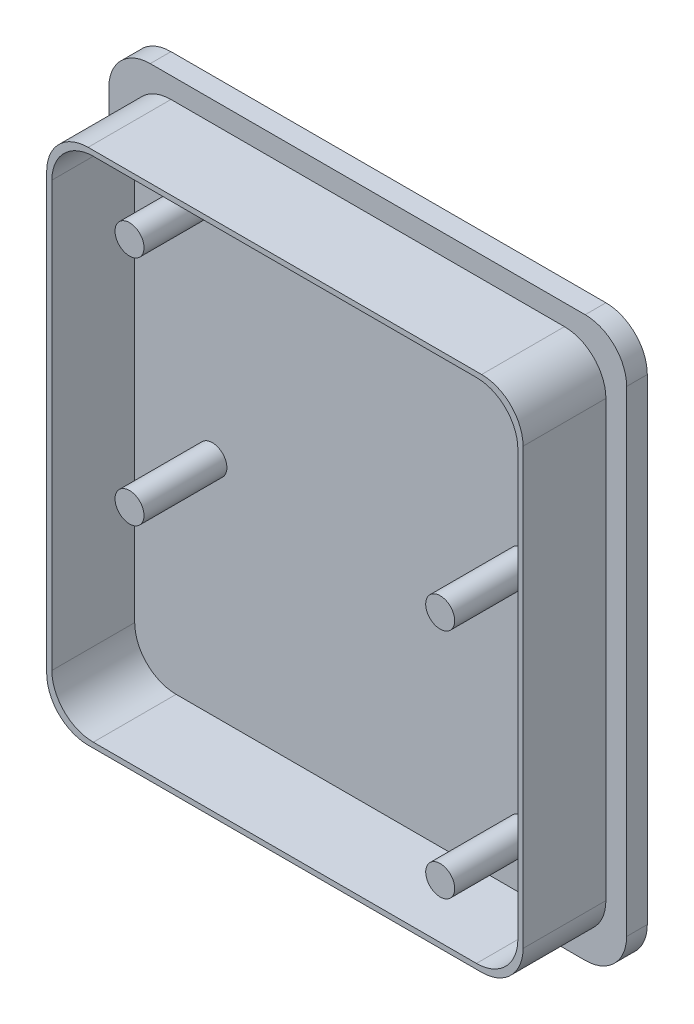
ISO-10303-21;
HEADER;
FILE_DESCRIPTION(('STEP AP214'),'2;1');
FILE_NAME('part.step','',(''),(''),'','','');
FILE_SCHEMA(('AUTOMOTIVE_DESIGN { 1 0 10303 214 1 1 1 1 }'));
ENDSEC;
DATA;
#1=APPLICATION_CONTEXT('core data for automotive mechanical design processes');
#2=APPLICATION_PROTOCOL_DEFINITION('international standard','automotive_design',2000,#1);
#3=PRODUCT_CONTEXT('',#1,'mechanical');
#4=PRODUCT('Part','Part','',(#3));
#5=PRODUCT_RELATED_PRODUCT_CATEGORY('part','',(#4));
#6=PRODUCT_DEFINITION_FORMATION('','',#4);
#7=PRODUCT_DEFINITION_CONTEXT('part definition',#1,'design');
#8=PRODUCT_DEFINITION('design','',#6,#7);
#9=PRODUCT_DEFINITION_SHAPE('','',#8);
#10=(LENGTH_UNIT() NAMED_UNIT(*) SI_UNIT(.MILLI.,.METRE.));
#11=(NAMED_UNIT(*) PLANE_ANGLE_UNIT() SI_UNIT($,.RADIAN.));
#12=(NAMED_UNIT(*) SI_UNIT($,.STERADIAN.) SOLID_ANGLE_UNIT());
#13=UNCERTAINTY_MEASURE_WITH_UNIT(LENGTH_MEASURE(1.E-05),#10,'distance_accuracy_value','');
#14=(GEOMETRIC_REPRESENTATION_CONTEXT(3) GLOBAL_UNCERTAINTY_ASSIGNED_CONTEXT((#13)) GLOBAL_UNIT_ASSIGNED_CONTEXT((#10,
#11,#12)) REPRESENTATION_CONTEXT('',''));
#15=CARTESIAN_POINT('',(0.,0.,0.));
#16=DIRECTION('',(0.,0.,1.));
#17=DIRECTION('',(1.,0.,0.));
#18=AXIS2_PLACEMENT_3D('',#15,#16,#17);
#19=CARTESIAN_POINT('',(-21.,23.,10.));
#20=DIRECTION('',(0.,0.,-1.));
#21=DIRECTION('',(-1.,0.,0.));
#22=AXIS2_PLACEMENT_3D('',#19,#20,#21);
#23=CYLINDRICAL_SURFACE('',#22,4.);
#24=CARTESIAN_POINT('',(-21.,23.,2.));
#25=DIRECTION('',(0.,0.,1.));
#26=DIRECTION('',(1.,0.,0.));
#27=AXIS2_PLACEMENT_3D('',#24,#25,#26);
#28=CIRCLE('',#27,4.);
#29=CARTESIAN_POINT('',(-21.,27.,2.));
#30=VERTEX_POINT('',#29);
#31=CARTESIAN_POINT('',(-25.,23.,2.));
#32=VERTEX_POINT('',#31);
#33=EDGE_CURVE('E250',#30,#32,#28,.T.);
#34=ORIENTED_EDGE('',*,*,#33,.F.);
#35=DIRECTION('',(0.,0.,-1.));
#36=VECTOR('',#35,1.);
#37=CARTESIAN_POINT('',(-21.,27.,10.));
#38=LINE('',#37,#36);
#39=CARTESIAN_POINT('',(-21.,27.,0.));
#40=VERTEX_POINT('',#39);
#41=EDGE_CURVE('E261',#30,#40,#38,.T.);
#42=ORIENTED_EDGE('',*,*,#41,.T.);
#43=CARTESIAN_POINT('',(-21.,23.,0.));
#44=DIRECTION('',(0.,0.,1.));
#45=DIRECTION('',(-1.,0.,0.));
#46=AXIS2_PLACEMENT_3D('',#43,#44,#45);
#47=CIRCLE('',#46,4.);
#48=CARTESIAN_POINT('',(-25.,23.,0.));
#49=VERTEX_POINT('',#48);
#50=EDGE_CURVE('E311',#40,#49,#47,.T.);
#51=ORIENTED_EDGE('',*,*,#50,.T.);
#52=DIRECTION('',(0.,0.,-1.));
#53=VECTOR('',#52,1.);
#54=CARTESIAN_POINT('',(-25.,23.,10.));
#55=LINE('',#54,#53);
#56=EDGE_CURVE('E12',#32,#49,#55,.T.);
#57=ORIENTED_EDGE('',*,*,#56,.F.);
#58=EDGE_LOOP('',(#34,#42,#51,#57));
#59=FACE_BOUND('',#58,.T.);
#60=ADVANCED_FACE('F88',(#59),#23,.T.);
#61=CARTESIAN_POINT('',(-25.,-23.,10.));
#62=DIRECTION('',(1.,0.,0.));
#63=DIRECTION('',(0.,1.,0.));
#64=AXIS2_PLACEMENT_3D('',#61,#62,#63);
#65=PLANE('',#64);
#66=DIRECTION('',(0.,-1.,0.));
#67=VECTOR('',#66,1.);
#68=CARTESIAN_POINT('',(-25.,0.,2.));
#69=LINE('',#68,#67);
#70=CARTESIAN_POINT('',(-25.,-23.,2.));
#71=VERTEX_POINT('',#70);
#72=EDGE_CURVE('E264',#32,#71,#69,.T.);
#73=ORIENTED_EDGE('',*,*,#72,.F.);
#74=ORIENTED_EDGE('',*,*,#56,.T.);
#75=DIRECTION('',(0.,-1.,0.));
#76=VECTOR('',#75,1.);
#77=CARTESIAN_POINT('',(-25.,-23.,0.));
#78=LINE('',#77,#76);
#79=CARTESIAN_POINT('',(-25.,-23.,0.));
#80=VERTEX_POINT('',#79);
#81=EDGE_CURVE('E307',#49,#80,#78,.T.);
#82=ORIENTED_EDGE('',*,*,#81,.T.);
#83=DIRECTION('',(0.,0.,-1.));
#84=VECTOR('',#83,1.);
#85=CARTESIAN_POINT('',(-25.,-23.,10.));
#86=LINE('',#85,#84);
#87=EDGE_CURVE('E96',#71,#80,#86,.T.);
#88=ORIENTED_EDGE('',*,*,#87,.F.);
#89=EDGE_LOOP('',(#73,#74,#82,#88));
#90=FACE_BOUND('',#89,.T.);
#91=ADVANCED_FACE('F308',(#90),#65,.F.);
#92=CARTESIAN_POINT('',(-21.,-23.,10.));
#93=DIRECTION('',(0.,0.,-1.));
#94=DIRECTION('',(-1.,0.,0.));
#95=AXIS2_PLACEMENT_3D('',#92,#93,#94);
#96=CYLINDRICAL_SURFACE('',#95,4.);
#97=CARTESIAN_POINT('',(-21.,-23.,2.));
#98=DIRECTION('',(0.,0.,1.));
#99=DIRECTION('',(1.,0.,0.));
#100=AXIS2_PLACEMENT_3D('',#97,#98,#99);
#101=CIRCLE('',#100,4.);
#102=CARTESIAN_POINT('',(-21.,-27.,2.));
#103=VERTEX_POINT('',#102);
#104=EDGE_CURVE('E304',#71,#103,#101,.T.);
#105=ORIENTED_EDGE('',*,*,#104,.F.);
#106=ORIENTED_EDGE('',*,*,#87,.T.);
#107=CARTESIAN_POINT('',(-21.,-23.,0.));
#108=DIRECTION('',(0.,0.,1.));
#109=DIRECTION('',(1.,0.,0.));
#110=AXIS2_PLACEMENT_3D('',#107,#108,#109);
#111=CIRCLE('',#110,4.);
#112=CARTESIAN_POINT('',(-21.,-27.,0.));
#113=VERTEX_POINT('',#112);
#114=EDGE_CURVE('E302',#80,#113,#111,.T.);
#115=ORIENTED_EDGE('',*,*,#114,.T.);
#116=DIRECTION('',(0.,0.,-1.));
#117=VECTOR('',#116,1.);
#118=CARTESIAN_POINT('',(-21.,-27.,10.));
#119=LINE('',#118,#117);
#120=EDGE_CURVE('E290',#103,#113,#119,.T.);
#121=ORIENTED_EDGE('',*,*,#120,.F.);
#122=EDGE_LOOP('',(#105,#106,#115,#121));
#123=FACE_BOUND('',#122,.T.);
#124=ADVANCED_FACE('F299',(#123),#96,.T.);
#125=CARTESIAN_POINT('',(-21.,-27.,10.));
#126=DIRECTION('',(0.,1.,0.));
#127=DIRECTION('',(-1.,0.,0.));
#128=AXIS2_PLACEMENT_3D('',#125,#126,#127);
#129=PLANE('',#128);
#130=DIRECTION('',(1.,0.,0.));
#131=VECTOR('',#130,1.);
#132=CARTESIAN_POINT('',(0.,-27.,2.));
#133=LINE('',#132,#131);
#134=CARTESIAN_POINT('',(21.,-27.,2.));
#135=VERTEX_POINT('',#134);
#136=EDGE_CURVE('E548',#103,#135,#133,.T.);
#137=ORIENTED_EDGE('',*,*,#136,.F.);
#138=ORIENTED_EDGE('',*,*,#120,.T.);
#139=DIRECTION('',(1.,0.,0.));
#140=VECTOR('',#139,1.);
#141=CARTESIAN_POINT('',(-21.,-27.,0.));
#142=LINE('',#141,#140);
#143=CARTESIAN_POINT('',(21.,-27.,0.));
#144=VERTEX_POINT('',#143);
#145=EDGE_CURVE('E316',#113,#144,#142,.T.);
#146=ORIENTED_EDGE('',*,*,#145,.T.);
#147=DIRECTION('',(0.,0.,-1.));
#148=VECTOR('',#147,1.);
#149=CARTESIAN_POINT('',(21.,-27.,10.));
#150=LINE('',#149,#148);
#151=EDGE_CURVE('E287',#135,#144,#150,.T.);
#152=ORIENTED_EDGE('',*,*,#151,.F.);
#153=EDGE_LOOP('',(#137,#138,#146,#152));
#154=FACE_BOUND('',#153,.T.);
#155=ADVANCED_FACE('F559',(#154),#129,.F.);
#156=CARTESIAN_POINT('',(21.,-23.,10.));
#157=DIRECTION('',(0.,0.,-1.));
#158=DIRECTION('',(-1.,0.,0.));
#159=AXIS2_PLACEMENT_3D('',#156,#157,#158);
#160=CYLINDRICAL_SURFACE('',#159,4.);
#161=CARTESIAN_POINT('',(21.,-23.,2.));
#162=DIRECTION('',(0.,0.,1.));
#163=DIRECTION('',(1.,0.,0.));
#164=AXIS2_PLACEMENT_3D('',#161,#162,#163);
#165=CIRCLE('',#164,4.);
#166=CARTESIAN_POINT('',(25.,-23.,2.));
#167=VERTEX_POINT('',#166);
#168=EDGE_CURVE('E545',#135,#167,#165,.T.);
#169=ORIENTED_EDGE('',*,*,#168,.F.);
#170=ORIENTED_EDGE('',*,*,#151,.T.);
#171=CARTESIAN_POINT('',(21.,-23.,0.));
#172=DIRECTION('',(0.,0.,1.));
#173=DIRECTION('',(-1.,0.,0.));
#174=AXIS2_PLACEMENT_3D('',#171,#172,#173);
#175=CIRCLE('',#174,4.);
#176=CARTESIAN_POINT('',(25.,-23.,0.));
#177=VERTEX_POINT('',#176);
#178=EDGE_CURVE('E321',#144,#177,#175,.T.);
#179=ORIENTED_EDGE('',*,*,#178,.T.);
#180=DIRECTION('',(0.,0.,-1.));
#181=VECTOR('',#180,1.);
#182=CARTESIAN_POINT('',(25.,-23.,10.));
#183=LINE('',#182,#181);
#184=EDGE_CURVE('E284',#167,#177,#183,.T.);
#185=ORIENTED_EDGE('',*,*,#184,.F.);
#186=EDGE_LOOP('',(#169,#170,#179,#185));
#187=FACE_BOUND('',#186,.T.);
#188=ADVANCED_FACE('F561',(#187),#160,.T.);
#189=CARTESIAN_POINT('',(25.,-23.,10.));
#190=DIRECTION('',(-1.,0.,0.));
#191=DIRECTION('',(0.,0.,1.));
#192=AXIS2_PLACEMENT_3D('',#189,#190,#191);
#193=PLANE('',#192);
#194=DIRECTION('',(0.,1.,0.));
#195=VECTOR('',#194,1.);
#196=CARTESIAN_POINT('',(25.,0.,2.));
#197=LINE('',#196,#195);
#198=CARTESIAN_POINT('',(25.,23.,2.));
#199=VERTEX_POINT('',#198);
#200=EDGE_CURVE('E542',#167,#199,#197,.T.);
#201=ORIENTED_EDGE('',*,*,#200,.F.);
#202=ORIENTED_EDGE('',*,*,#184,.T.);
#203=DIRECTION('',(0.,1.,0.));
#204=VECTOR('',#203,1.);
#205=CARTESIAN_POINT('',(25.,-23.,0.));
#206=LINE('',#205,#204);
#207=CARTESIAN_POINT('',(25.,23.,0.));
#208=VERTEX_POINT('',#207);
#209=EDGE_CURVE('E328',#177,#208,#206,.T.);
#210=ORIENTED_EDGE('',*,*,#209,.T.);
#211=DIRECTION('',(0.,0.,-1.));
#212=VECTOR('',#211,1.);
#213=CARTESIAN_POINT('',(25.,23.,10.));
#214=LINE('',#213,#212);
#215=EDGE_CURVE('E276',#199,#208,#214,.T.);
#216=ORIENTED_EDGE('',*,*,#215,.F.);
#217=EDGE_LOOP('',(#201,#202,#210,#216));
#218=FACE_BOUND('',#217,.T.);
#219=ADVANCED_FACE('F565',(#218),#193,.F.);
#220=CARTESIAN_POINT('',(21.,23.,10.));
#221=DIRECTION('',(0.,0.,-1.));
#222=DIRECTION('',(-1.,0.,0.));
#223=AXIS2_PLACEMENT_3D('',#220,#221,#222);
#224=CYLINDRICAL_SURFACE('',#223,4.);
#225=CARTESIAN_POINT('',(21.,23.,2.));
#226=DIRECTION('',(0.,0.,1.));
#227=DIRECTION('',(1.,0.,0.));
#228=AXIS2_PLACEMENT_3D('',#225,#226,#227);
#229=CIRCLE('',#228,4.);
#230=CARTESIAN_POINT('',(21.,27.,2.));
#231=VERTEX_POINT('',#230);
#232=EDGE_CURVE('E103',#199,#231,#229,.T.);
#233=ORIENTED_EDGE('',*,*,#232,.F.);
#234=ORIENTED_EDGE('',*,*,#215,.T.);
#235=CARTESIAN_POINT('',(21.,23.,0.));
#236=DIRECTION('',(0.,0.,1.));
#237=DIRECTION('',(1.,0.,0.));
#238=AXIS2_PLACEMENT_3D('',#235,#236,#237);
#239=CIRCLE('',#238,4.);
#240=CARTESIAN_POINT('',(21.,27.,0.));
#241=VERTEX_POINT('',#240);
#242=EDGE_CURVE('E278',#208,#241,#239,.T.);
#243=ORIENTED_EDGE('',*,*,#242,.T.);
#244=DIRECTION('',(0.,0.,-1.));
#245=VECTOR('',#244,1.);
#246=CARTESIAN_POINT('',(21.,27.,10.));
#247=LINE('',#246,#245);
#248=EDGE_CURVE('E271',#231,#241,#247,.T.);
#249=ORIENTED_EDGE('',*,*,#248,.F.);
#250=EDGE_LOOP('',(#233,#234,#243,#249));
#251=FACE_BOUND('',#250,.T.);
#252=ADVANCED_FACE('F336',(#251),#224,.T.);
#253=CARTESIAN_POINT('',(-21.,27.,10.));
#254=DIRECTION('',(0.,-1.,0.));
#255=DIRECTION('',(1.,0.,0.));
#256=AXIS2_PLACEMENT_3D('',#253,#254,#255);
#257=PLANE('',#256);
#258=DIRECTION('',(-1.,0.,0.));
#259=VECTOR('',#258,1.);
#260=CARTESIAN_POINT('',(0.,27.,2.));
#261=LINE('',#260,#259);
#262=EDGE_CURVE('E246',#231,#30,#261,.T.);
#263=ORIENTED_EDGE('',*,*,#262,.F.);
#264=ORIENTED_EDGE('',*,*,#248,.T.);
#265=DIRECTION('',(-1.,0.,0.));
#266=VECTOR('',#265,1.);
#267=CARTESIAN_POINT('',(-21.,27.,0.));
#268=LINE('',#267,#266);
#269=EDGE_CURVE('E268',#241,#40,#268,.T.);
#270=ORIENTED_EDGE('',*,*,#269,.T.);
#271=ORIENTED_EDGE('',*,*,#41,.F.);
#272=EDGE_LOOP('',(#263,#264,#270,#271));
#273=FACE_BOUND('',#272,.T.);
#274=ADVANCED_FACE('F266',(#273),#257,.F.);
#275=CARTESIAN_POINT('',(-21.,23.,0.));
#276=DIRECTION('',(0.,0.,-1.));
#277=DIRECTION('',(-1.,0.,0.));
#278=AXIS2_PLACEMENT_3D('',#275,#276,#277);
#279=PLANE('',#278);
#280=ORIENTED_EDGE('',*,*,#50,.F.);
#281=ORIENTED_EDGE('',*,*,#269,.F.);
#282=ORIENTED_EDGE('',*,*,#242,.F.);
#283=ORIENTED_EDGE('',*,*,#209,.F.);
#284=ORIENTED_EDGE('',*,*,#178,.F.);
#285=ORIENTED_EDGE('',*,*,#145,.F.);
#286=ORIENTED_EDGE('',*,*,#114,.F.);
#287=ORIENTED_EDGE('',*,*,#81,.F.);
#288=EDGE_LOOP('',(#280,#281,#282,#283,#284,#285,#286,#287));
#289=FACE_BOUND('',#288,.T.);
#290=ADVANCED_FACE('F313',(#289),#279,.T.);
#291=CARTESIAN_POINT('',(0.,-25.,2.));
#292=DIRECTION('',(0.,-1.,0.));
#293=DIRECTION('',(0.,0.,-1.));
#294=AXIS2_PLACEMENT_3D('',#291,#292,#293);
#295=PLANE('',#294);
#296=DIRECTION('',(1.,0.,0.));
#297=VECTOR('',#296,1.);
#298=CARTESIAN_POINT('',(0.,-25.,10.));
#299=LINE('',#298,#297);
#300=CARTESIAN_POINT('',(-19.,-25.,10.));
#301=VERTEX_POINT('',#300);
#302=CARTESIAN_POINT('',(19.,-25.,10.));
#303=VERTEX_POINT('',#302);
#304=EDGE_CURVE('E111',#301,#303,#299,.T.);
#305=ORIENTED_EDGE('',*,*,#304,.F.);
#306=DIRECTION('',(0.,0.,1.));
#307=VECTOR('',#306,1.);
#308=CARTESIAN_POINT('',(-19.,-25.,2.));
#309=LINE('',#308,#307);
#310=CARTESIAN_POINT('',(-19.,-25.,2.));
#311=VERTEX_POINT('',#310);
#312=EDGE_CURVE('E460',#311,#301,#309,.T.);
#313=ORIENTED_EDGE('',*,*,#312,.F.);
#314=DIRECTION('',(1.,0.,0.));
#315=VECTOR('',#314,1.);
#316=CARTESIAN_POINT('',(0.,-25.,2.));
#317=LINE('',#316,#315);
#318=CARTESIAN_POINT('',(19.,-25.,2.));
#319=VERTEX_POINT('',#318);
#320=EDGE_CURVE('E536',#311,#319,#317,.T.);
#321=ORIENTED_EDGE('',*,*,#320,.T.);
#322=DIRECTION('',(0.,0.,1.));
#323=VECTOR('',#322,1.);
#324=CARTESIAN_POINT('',(19.,-25.,2.));
#325=LINE('',#324,#323);
#326=EDGE_CURVE('E416',#319,#303,#325,.T.);
#327=ORIENTED_EDGE('',*,*,#326,.T.);
#328=EDGE_LOOP('',(#305,#313,#321,#327));
#329=FACE_BOUND('',#328,.T.);
#330=ADVANCED_FACE('F620',(#329),#295,.T.);
#331=CARTESIAN_POINT('',(19.,-21.,2.));
#332=DIRECTION('',(0.,0.,1.));
#333=DIRECTION('',(1.,0.,0.));
#334=AXIS2_PLACEMENT_3D('',#331,#332,#333);
#335=CYLINDRICAL_SURFACE('',#334,4.);
#336=CARTESIAN_POINT('',(19.,-21.,10.));
#337=DIRECTION('',(0.,0.,1.));
#338=DIRECTION('',(1.,0.,0.));
#339=AXIS2_PLACEMENT_3D('',#336,#337,#338);
#340=CIRCLE('',#339,4.);
#341=CARTESIAN_POINT('',(23.,-21.,10.));
#342=VERTEX_POINT('',#341);
#343=EDGE_CURVE('E256',#303,#342,#340,.T.);
#344=ORIENTED_EDGE('',*,*,#343,.F.);
#345=ORIENTED_EDGE('',*,*,#326,.F.);
#346=CARTESIAN_POINT('',(19.,-21.,2.));
#347=DIRECTION('',(0.,0.,1.));
#348=DIRECTION('',(1.,0.,0.));
#349=AXIS2_PLACEMENT_3D('',#346,#347,#348);
#350=CIRCLE('',#349,4.);
#351=CARTESIAN_POINT('',(23.,-21.,2.));
#352=VERTEX_POINT('',#351);
#353=EDGE_CURVE('E464',#319,#352,#350,.T.);
#354=ORIENTED_EDGE('',*,*,#353,.T.);
#355=DIRECTION('',(0.,0.,1.));
#356=VECTOR('',#355,1.);
#357=CARTESIAN_POINT('',(23.,-21.,2.));
#358=LINE('',#357,#356);
#359=EDGE_CURVE('E479',#352,#342,#358,.T.);
#360=ORIENTED_EDGE('',*,*,#359,.T.);
#361=EDGE_LOOP('',(#344,#345,#354,#360));
#362=FACE_BOUND('',#361,.T.);
#363=ADVANCED_FACE('F629',(#362),#335,.T.);
#364=CARTESIAN_POINT('',(23.,0.,2.));
#365=DIRECTION('',(-1.,0.,0.));
#366=DIRECTION('',(0.,-1.,0.));
#367=AXIS2_PLACEMENT_3D('',#364,#365,#366);
#368=PLANE('',#367);
#369=DIRECTION('',(0.,-1.,0.));
#370=VECTOR('',#369,1.);
#371=CARTESIAN_POINT('',(23.,0.,10.));
#372=LINE('',#371,#370);
#373=CARTESIAN_POINT('',(23.,21.,10.));
#374=VERTEX_POINT('',#373);
#375=EDGE_CURVE('E487',#374,#342,#372,.T.);
#376=ORIENTED_EDGE('',*,*,#375,.T.);
#377=ORIENTED_EDGE('',*,*,#359,.F.);
#378=DIRECTION('',(0.,-1.,0.));
#379=VECTOR('',#378,1.);
#380=CARTESIAN_POINT('',(23.,0.,2.));
#381=LINE('',#380,#379);
#382=CARTESIAN_POINT('',(23.,21.,2.));
#383=VERTEX_POINT('',#382);
#384=EDGE_CURVE('E515',#383,#352,#381,.T.);
#385=ORIENTED_EDGE('',*,*,#384,.F.);
#386=DIRECTION('',(0.,0.,1.));
#387=VECTOR('',#386,1.);
#388=CARTESIAN_POINT('',(23.,21.,2.));
#389=LINE('',#388,#387);
#390=EDGE_CURVE('E476',#383,#374,#389,.T.);
#391=ORIENTED_EDGE('',*,*,#390,.T.);
#392=EDGE_LOOP('',(#376,#377,#385,#391));
#393=FACE_BOUND('',#392,.T.);
#394=ADVANCED_FACE('F638',(#393),#368,.F.);
#395=CARTESIAN_POINT('',(19.,21.,2.));
#396=DIRECTION('',(0.,0.,1.));
#397=DIRECTION('',(1.,0.,0.));
#398=AXIS2_PLACEMENT_3D('',#395,#396,#397);
#399=CYLINDRICAL_SURFACE('',#398,4.);
#400=CARTESIAN_POINT('',(19.,21.,10.));
#401=DIRECTION('',(0.,0.,1.));
#402=DIRECTION('',(1.,0.,0.));
#403=AXIS2_PLACEMENT_3D('',#400,#401,#402);
#404=CIRCLE('',#403,4.);
#405=CARTESIAN_POINT('',(19.,25.,10.));
#406=VERTEX_POINT('',#405);
#407=EDGE_CURVE('E491',#374,#406,#404,.T.);
#408=ORIENTED_EDGE('',*,*,#407,.F.);
#409=ORIENTED_EDGE('',*,*,#390,.F.);
#410=CARTESIAN_POINT('',(19.,21.,2.));
#411=DIRECTION('',(0.,0.,1.));
#412=DIRECTION('',(1.,0.,0.));
#413=AXIS2_PLACEMENT_3D('',#410,#411,#412);
#414=CIRCLE('',#413,4.);
#415=CARTESIAN_POINT('',(19.,25.,2.));
#416=VERTEX_POINT('',#415);
#417=EDGE_CURVE('E519',#383,#416,#414,.T.);
#418=ORIENTED_EDGE('',*,*,#417,.T.);
#419=DIRECTION('',(0.,0.,1.));
#420=VECTOR('',#419,1.);
#421=CARTESIAN_POINT('',(19.,25.,2.));
#422=LINE('',#421,#420);
#423=EDGE_CURVE('E473',#416,#406,#422,.T.);
#424=ORIENTED_EDGE('',*,*,#423,.T.);
#425=EDGE_LOOP('',(#408,#409,#418,#424));
#426=FACE_BOUND('',#425,.T.);
#427=ADVANCED_FACE('F648',(#426),#399,.T.);
#428=CARTESIAN_POINT('',(0.,25.,2.));
#429=DIRECTION('',(0.,-1.,0.));
#430=DIRECTION('',(0.,0.,-1.));
#431=AXIS2_PLACEMENT_3D('',#428,#429,#430);
#432=PLANE('',#431);
#433=DIRECTION('',(1.,0.,0.));
#434=VECTOR('',#433,1.);
#435=CARTESIAN_POINT('',(0.,25.,10.));
#436=LINE('',#435,#434);
#437=CARTESIAN_POINT('',(-19.,25.,10.));
#438=VERTEX_POINT('',#437);
#439=EDGE_CURVE('E495',#438,#406,#436,.T.);
#440=ORIENTED_EDGE('',*,*,#439,.T.);
#441=ORIENTED_EDGE('',*,*,#423,.F.);
#442=DIRECTION('',(1.,0.,0.));
#443=VECTOR('',#442,1.);
#444=CARTESIAN_POINT('',(0.,25.,2.));
#445=LINE('',#444,#443);
#446=CARTESIAN_POINT('',(-19.,25.,2.));
#447=VERTEX_POINT('',#446);
#448=EDGE_CURVE('E522',#447,#416,#445,.T.);
#449=ORIENTED_EDGE('',*,*,#448,.F.);
#450=DIRECTION('',(0.,0.,1.));
#451=VECTOR('',#450,1.);
#452=CARTESIAN_POINT('',(-19.,25.,2.));
#453=LINE('',#452,#451);
#454=EDGE_CURVE('E470',#447,#438,#453,.T.);
#455=ORIENTED_EDGE('',*,*,#454,.T.);
#456=EDGE_LOOP('',(#440,#441,#449,#455));
#457=FACE_BOUND('',#456,.T.);
#458=ADVANCED_FACE('F658',(#457),#432,.F.);
#459=CARTESIAN_POINT('',(-19.,21.,2.));
#460=DIRECTION('',(0.,0.,1.));
#461=DIRECTION('',(1.,0.,0.));
#462=AXIS2_PLACEMENT_3D('',#459,#460,#461);
#463=CYLINDRICAL_SURFACE('',#462,4.);
#464=CARTESIAN_POINT('',(-19.,21.,10.));
#465=DIRECTION('',(0.,0.,1.));
#466=DIRECTION('',(1.,0.,0.));
#467=AXIS2_PLACEMENT_3D('',#464,#465,#466);
#468=CIRCLE('',#467,4.);
#469=CARTESIAN_POINT('',(-23.,21.,10.));
#470=VERTEX_POINT('',#469);
#471=EDGE_CURVE('E499',#438,#470,#468,.T.);
#472=ORIENTED_EDGE('',*,*,#471,.F.);
#473=ORIENTED_EDGE('',*,*,#454,.F.);
#474=CARTESIAN_POINT('',(-19.,21.,2.));
#475=DIRECTION('',(0.,0.,1.));
#476=DIRECTION('',(1.,0.,0.));
#477=AXIS2_PLACEMENT_3D('',#474,#475,#476);
#478=CIRCLE('',#477,4.);
#479=CARTESIAN_POINT('',(-23.,21.,2.));
#480=VERTEX_POINT('',#479);
#481=EDGE_CURVE('E526',#447,#480,#478,.T.);
#482=ORIENTED_EDGE('',*,*,#481,.T.);
#483=DIRECTION('',(0.,0.,1.));
#484=VECTOR('',#483,1.);
#485=CARTESIAN_POINT('',(-23.,21.,2.));
#486=LINE('',#485,#484);
#487=EDGE_CURVE('E467',#480,#470,#486,.T.);
#488=ORIENTED_EDGE('',*,*,#487,.T.);
#489=EDGE_LOOP('',(#472,#473,#482,#488));
#490=FACE_BOUND('',#489,.T.);
#491=ADVANCED_FACE('F668',(#490),#463,.T.);
#492=CARTESIAN_POINT('',(-23.,0.,2.));
#493=DIRECTION('',(-1.,0.,0.));
#494=DIRECTION('',(0.,-1.,0.));
#495=AXIS2_PLACEMENT_3D('',#492,#493,#494);
#496=PLANE('',#495);
#497=DIRECTION('',(0.,-1.,0.));
#498=VECTOR('',#497,1.);
#499=CARTESIAN_POINT('',(-23.,0.,10.));
#500=LINE('',#499,#498);
#501=CARTESIAN_POINT('',(-23.,-21.,10.));
#502=VERTEX_POINT('',#501);
#503=EDGE_CURVE('E503',#470,#502,#500,.T.);
#504=ORIENTED_EDGE('',*,*,#503,.F.);
#505=ORIENTED_EDGE('',*,*,#487,.F.);
#506=DIRECTION('',(0.,-1.,0.));
#507=VECTOR('',#506,1.);
#508=CARTESIAN_POINT('',(-23.,0.,2.));
#509=LINE('',#508,#507);
#510=CARTESIAN_POINT('',(-23.,-21.,2.));
#511=VERTEX_POINT('',#510);
#512=EDGE_CURVE('E529',#480,#511,#509,.T.);
#513=ORIENTED_EDGE('',*,*,#512,.T.);
#514=DIRECTION('',(0.,0.,1.));
#515=VECTOR('',#514,1.);
#516=CARTESIAN_POINT('',(-23.,-21.,2.));
#517=LINE('',#516,#515);
#518=EDGE_CURVE('E463',#511,#502,#517,.T.);
#519=ORIENTED_EDGE('',*,*,#518,.T.);
#520=EDGE_LOOP('',(#504,#505,#513,#519));
#521=FACE_BOUND('',#520,.T.);
#522=ADVANCED_FACE('F678',(#521),#496,.T.);
#523=CARTESIAN_POINT('',(-19.,-21.,2.));
#524=DIRECTION('',(0.,0.,1.));
#525=DIRECTION('',(1.,0.,0.));
#526=AXIS2_PLACEMENT_3D('',#523,#524,#525);
#527=CYLINDRICAL_SURFACE('',#526,4.);
#528=CARTESIAN_POINT('',(-19.,-21.,10.));
#529=DIRECTION('',(0.,0.,1.));
#530=DIRECTION('',(1.,0.,0.));
#531=AXIS2_PLACEMENT_3D('',#528,#529,#530);
#532=CIRCLE('',#531,4.);
#533=EDGE_CURVE('E507',#301,#502,#532,.F.);
#534=ORIENTED_EDGE('',*,*,#533,.T.);
#535=ORIENTED_EDGE('',*,*,#518,.F.);
#536=CARTESIAN_POINT('',(-19.,-21.,2.));
#537=DIRECTION('',(0.,0.,1.));
#538=DIRECTION('',(1.,0.,0.));
#539=AXIS2_PLACEMENT_3D('',#536,#537,#538);
#540=CIRCLE('',#539,4.);
#541=EDGE_CURVE('E532',#311,#511,#540,.F.);
#542=ORIENTED_EDGE('',*,*,#541,.F.);
#543=ORIENTED_EDGE('',*,*,#312,.T.);
#544=EDGE_LOOP('',(#534,#535,#542,#543));
#545=FACE_BOUND('',#544,.T.);
#546=ADVANCED_FACE('F688',(#545),#527,.T.);
#547=CARTESIAN_POINT('',(0.,0.,2.));
#548=DIRECTION('',(0.,0.,1.));
#549=DIRECTION('',(1.,0.,0.));
#550=AXIS2_PLACEMENT_3D('',#547,#548,#549);
#551=PLANE('',#550);
#552=ORIENTED_EDGE('',*,*,#262,.T.);
#553=ORIENTED_EDGE('',*,*,#33,.T.);
#554=ORIENTED_EDGE('',*,*,#72,.T.);
#555=ORIENTED_EDGE('',*,*,#104,.T.);
#556=ORIENTED_EDGE('',*,*,#136,.T.);
#557=ORIENTED_EDGE('',*,*,#168,.T.);
#558=ORIENTED_EDGE('',*,*,#200,.T.);
#559=ORIENTED_EDGE('',*,*,#232,.T.);
#560=EDGE_LOOP('',(#552,#553,#554,#555,#556,#557,#558,#559));
#561=FACE_BOUND('',#560,.T.);
#562=ORIENTED_EDGE('',*,*,#320,.F.);
#563=ORIENTED_EDGE('',*,*,#541,.T.);
#564=ORIENTED_EDGE('',*,*,#512,.F.);
#565=ORIENTED_EDGE('',*,*,#481,.F.);
#566=ORIENTED_EDGE('',*,*,#448,.T.);
#567=ORIENTED_EDGE('',*,*,#417,.F.);
#568=ORIENTED_EDGE('',*,*,#384,.T.);
#569=ORIENTED_EDGE('',*,*,#353,.F.);
#570=EDGE_LOOP('',(#562,#563,#564,#565,#566,#567,#568,#569));
#571=FACE_BOUND('',#570,.T.);
#572=ADVANCED_FACE('F248',(#561,#571),#551,.T.);
#573=CARTESIAN_POINT('',(-21.,23.,10.));
#574=DIRECTION('',(0.,0.,-1.));
#575=DIRECTION('',(-1.,0.,0.));
#576=AXIS2_PLACEMENT_3D('',#573,#574,#575);
#577=PLANE('',#576);
#578=CARTESIAN_POINT('',(18.5,-20.5,10.));
#579=DIRECTION('',(0.,0.,1.));
#580=DIRECTION('',(1.,0.,0.));
#581=AXIS2_PLACEMENT_3D('',#578,#579,#580);
#582=CIRCLE('',#581,4.);
#583=CARTESIAN_POINT('',(18.5,-24.5,10.));
#584=VERTEX_POINT('',#583);
#585=CARTESIAN_POINT('',(22.5,-20.5,10.));
#586=VERTEX_POINT('',#585);
#587=EDGE_CURVE('E393',#584,#586,#582,.T.);
#588=ORIENTED_EDGE('',*,*,#587,.F.);
#589=DIRECTION('',(1.,0.,0.));
#590=VECTOR('',#589,1.);
#591=CARTESIAN_POINT('',(0.,-24.5,10.));
#592=LINE('',#591,#590);
#593=CARTESIAN_POINT('',(-18.5,-24.5,10.));
#594=VERTEX_POINT('',#593);
#595=EDGE_CURVE('E397',#594,#584,#592,.T.);
#596=ORIENTED_EDGE('',*,*,#595,.F.);
#597=CARTESIAN_POINT('',(-18.5,-20.5,10.));
#598=DIRECTION('',(0.,0.,1.));
#599=DIRECTION('',(1.,0.,0.));
#600=AXIS2_PLACEMENT_3D('',#597,#598,#599);
#601=CIRCLE('',#600,4.);
#602=CARTESIAN_POINT('',(-22.5,-20.5,10.));
#603=VERTEX_POINT('',#602);
#604=EDGE_CURVE('E368',#594,#603,#601,.F.);
#605=ORIENTED_EDGE('',*,*,#604,.T.);
#606=DIRECTION('',(0.,-1.,0.));
#607=VECTOR('',#606,1.);
#608=CARTESIAN_POINT('',(-22.5,0.,10.));
#609=LINE('',#608,#607);
#610=CARTESIAN_POINT('',(-22.5,20.5,10.));
#611=VERTEX_POINT('',#610);
#612=EDGE_CURVE('E373',#611,#603,#609,.T.);
#613=ORIENTED_EDGE('',*,*,#612,.F.);
#614=CARTESIAN_POINT('',(-18.5,20.5,10.));
#615=DIRECTION('',(0.,0.,1.));
#616=DIRECTION('',(1.,0.,0.));
#617=AXIS2_PLACEMENT_3D('',#614,#615,#616);
#618=CIRCLE('',#617,4.);
#619=CARTESIAN_POINT('',(-18.5,24.5,10.));
#620=VERTEX_POINT('',#619);
#621=EDGE_CURVE('E377',#620,#611,#618,.T.);
#622=ORIENTED_EDGE('',*,*,#621,.F.);
#623=DIRECTION('',(1.,0.,0.));
#624=VECTOR('',#623,1.);
#625=CARTESIAN_POINT('',(0.,24.5,10.));
#626=LINE('',#625,#624);
#627=CARTESIAN_POINT('',(18.5,24.5,10.));
#628=VERTEX_POINT('',#627);
#629=EDGE_CURVE('E381',#620,#628,#626,.T.);
#630=ORIENTED_EDGE('',*,*,#629,.T.);
#631=CARTESIAN_POINT('',(18.5,20.5,10.));
#632=DIRECTION('',(0.,0.,1.));
#633=DIRECTION('',(1.,0.,0.));
#634=AXIS2_PLACEMENT_3D('',#631,#632,#633);
#635=CIRCLE('',#634,4.);
#636=CARTESIAN_POINT('',(22.5,20.5,10.));
#637=VERTEX_POINT('',#636);
#638=EDGE_CURVE('E385',#637,#628,#635,.T.);
#639=ORIENTED_EDGE('',*,*,#638,.F.);
#640=DIRECTION('',(0.,-1.,0.));
#641=VECTOR('',#640,1.);
#642=CARTESIAN_POINT('',(22.5,0.,10.));
#643=LINE('',#642,#641);
#644=EDGE_CURVE('E389',#637,#586,#643,.T.);
#645=ORIENTED_EDGE('',*,*,#644,.T.);
#646=EDGE_LOOP('',(#588,#596,#605,#613,#622,#630,#639,#645));
#647=FACE_BOUND('',#646,.T.);
#648=ORIENTED_EDGE('',*,*,#304,.T.);
#649=ORIENTED_EDGE('',*,*,#343,.T.);
#650=ORIENTED_EDGE('',*,*,#375,.F.);
#651=ORIENTED_EDGE('',*,*,#407,.T.);
#652=ORIENTED_EDGE('',*,*,#439,.F.);
#653=ORIENTED_EDGE('',*,*,#471,.T.);
#654=ORIENTED_EDGE('',*,*,#503,.T.);
#655=ORIENTED_EDGE('',*,*,#533,.F.);
#656=EDGE_LOOP('',(#648,#649,#650,#651,#652,#653,#654,#655));
#657=FACE_BOUND('',#656,.T.);
#658=ADVANCED_FACE('F707',(#647,#657),#577,.F.);
#659=CARTESIAN_POINT('',(0.,-24.5,2.));
#660=DIRECTION('',(0.,-1.,0.));
#661=DIRECTION('',(0.,0.,-1.));
#662=AXIS2_PLACEMENT_3D('',#659,#660,#661);
#663=PLANE('',#662);
#664=ORIENTED_EDGE('',*,*,#595,.T.);
#665=DIRECTION('',(0.,0.,1.));
#666=VECTOR('',#665,1.);
#667=CARTESIAN_POINT('',(18.5,-24.5,2.));
#668=LINE('',#667,#666);
#669=CARTESIAN_POINT('',(18.5,-24.5,2.));
#670=VERTEX_POINT('',#669);
#671=EDGE_CURVE('E346',#670,#584,#668,.T.);
#672=ORIENTED_EDGE('',*,*,#671,.F.);
#673=DIRECTION('',(1.,0.,0.));
#674=VECTOR('',#673,1.);
#675=CARTESIAN_POINT('',(0.,-24.5,2.));
#676=LINE('',#675,#674);
#677=CARTESIAN_POINT('',(-18.5,-24.5,2.));
#678=VERTEX_POINT('',#677);
#679=EDGE_CURVE('E441',#678,#670,#676,.T.);
#680=ORIENTED_EDGE('',*,*,#679,.F.);
#681=DIRECTION('',(0.,0.,1.));
#682=VECTOR('',#681,1.);
#683=CARTESIAN_POINT('',(-18.5,-24.5,2.));
#684=LINE('',#683,#682);
#685=EDGE_CURVE('E340',#678,#594,#684,.T.);
#686=ORIENTED_EDGE('',*,*,#685,.T.);
#687=EDGE_LOOP('',(#664,#672,#680,#686));
#688=FACE_BOUND('',#687,.T.);
#689=ADVANCED_FACE('F716',(#688),#663,.F.);
#690=CARTESIAN_POINT('',(-18.5,-20.5,2.));
#691=DIRECTION('',(0.,0.,1.));
#692=DIRECTION('',(1.,0.,0.));
#693=AXIS2_PLACEMENT_3D('',#690,#691,#692);
#694=CYLINDRICAL_SURFACE('',#693,4.);
#695=ORIENTED_EDGE('',*,*,#604,.F.);
#696=ORIENTED_EDGE('',*,*,#685,.F.);
#697=CARTESIAN_POINT('',(-18.5,-20.5,2.));
#698=DIRECTION('',(0.,0.,1.));
#699=DIRECTION('',(1.,0.,0.));
#700=AXIS2_PLACEMENT_3D('',#697,#698,#699);
#701=CIRCLE('',#700,4.);
#702=CARTESIAN_POINT('',(-22.5,-20.5,2.));
#703=VERTEX_POINT('',#702);
#704=EDGE_CURVE('E351',#678,#703,#701,.F.);
#705=ORIENTED_EDGE('',*,*,#704,.T.);
#706=DIRECTION('',(0.,0.,1.));
#707=VECTOR('',#706,1.);
#708=CARTESIAN_POINT('',(-22.5,-20.5,2.));
#709=LINE('',#708,#707);
#710=EDGE_CURVE('E343',#703,#603,#709,.T.);
#711=ORIENTED_EDGE('',*,*,#710,.T.);
#712=EDGE_LOOP('',(#695,#696,#705,#711));
#713=FACE_BOUND('',#712,.T.);
#714=ADVANCED_FACE('F728',(#713),#694,.F.);
#715=CARTESIAN_POINT('',(-22.5,0.,2.));
#716=DIRECTION('',(-1.,0.,0.));
#717=DIRECTION('',(0.,-1.,0.));
#718=AXIS2_PLACEMENT_3D('',#715,#716,#717);
#719=PLANE('',#718);
#720=ORIENTED_EDGE('',*,*,#612,.T.);
#721=ORIENTED_EDGE('',*,*,#710,.F.);
#722=DIRECTION('',(0.,-1.,0.));
#723=VECTOR('',#722,1.);
#724=CARTESIAN_POINT('',(-22.5,0.,2.));
#725=LINE('',#724,#723);
#726=CARTESIAN_POINT('',(-22.5,20.5,2.));
#727=VERTEX_POINT('',#726);
#728=EDGE_CURVE('E419',#727,#703,#725,.T.);
#729=ORIENTED_EDGE('',*,*,#728,.F.);
#730=DIRECTION('',(0.,0.,1.));
#731=VECTOR('',#730,1.);
#732=CARTESIAN_POINT('',(-22.5,20.5,2.));
#733=LINE('',#732,#731);
#734=EDGE_CURVE('E363',#727,#611,#733,.T.);
#735=ORIENTED_EDGE('',*,*,#734,.T.);
#736=EDGE_LOOP('',(#720,#721,#729,#735));
#737=FACE_BOUND('',#736,.T.);
#738=ADVANCED_FACE('F738',(#737),#719,.F.);
#739=CARTESIAN_POINT('',(-18.5,20.5,2.));
#740=DIRECTION('',(0.,0.,1.));
#741=DIRECTION('',(1.,0.,0.));
#742=AXIS2_PLACEMENT_3D('',#739,#740,#741);
#743=CYLINDRICAL_SURFACE('',#742,4.);
#744=ORIENTED_EDGE('',*,*,#621,.T.);
#745=ORIENTED_EDGE('',*,*,#734,.F.);
#746=CARTESIAN_POINT('',(-18.5,20.5,2.));
#747=DIRECTION('',(0.,0.,1.));
#748=DIRECTION('',(1.,0.,0.));
#749=AXIS2_PLACEMENT_3D('',#746,#747,#748);
#750=CIRCLE('',#749,4.);
#751=CARTESIAN_POINT('',(-18.5,24.5,2.));
#752=VERTEX_POINT('',#751);
#753=EDGE_CURVE('E423',#752,#727,#750,.T.);
#754=ORIENTED_EDGE('',*,*,#753,.F.);
#755=DIRECTION('',(0.,0.,1.));
#756=VECTOR('',#755,1.);
#757=CARTESIAN_POINT('',(-18.5,24.5,2.));
#758=LINE('',#757,#756);
#759=EDGE_CURVE('E360',#752,#620,#758,.T.);
#760=ORIENTED_EDGE('',*,*,#759,.T.);
#761=EDGE_LOOP('',(#744,#745,#754,#760));
#762=FACE_BOUND('',#761,.T.);
#763=ADVANCED_FACE('F748',(#762),#743,.F.);
#764=CARTESIAN_POINT('',(0.,24.5,2.));
#765=DIRECTION('',(0.,-1.,0.));
#766=DIRECTION('',(0.,0.,-1.));
#767=AXIS2_PLACEMENT_3D('',#764,#765,#766);
#768=PLANE('',#767);
#769=ORIENTED_EDGE('',*,*,#629,.F.);
#770=ORIENTED_EDGE('',*,*,#759,.F.);
#771=DIRECTION('',(1.,0.,0.));
#772=VECTOR('',#771,1.);
#773=CARTESIAN_POINT('',(0.,24.5,2.));
#774=LINE('',#773,#772);
#775=CARTESIAN_POINT('',(18.5,24.5,2.));
#776=VERTEX_POINT('',#775);
#777=EDGE_CURVE('E427',#752,#776,#774,.T.);
#778=ORIENTED_EDGE('',*,*,#777,.T.);
#779=DIRECTION('',(0.,0.,1.));
#780=VECTOR('',#779,1.);
#781=CARTESIAN_POINT('',(18.5,24.5,2.));
#782=LINE('',#781,#780);
#783=EDGE_CURVE('E357',#776,#628,#782,.T.);
#784=ORIENTED_EDGE('',*,*,#783,.T.);
#785=EDGE_LOOP('',(#769,#770,#778,#784));
#786=FACE_BOUND('',#785,.T.);
#787=ADVANCED_FACE('F758',(#786),#768,.T.);
#788=CARTESIAN_POINT('',(18.5,20.5,2.));
#789=DIRECTION('',(0.,0.,1.));
#790=DIRECTION('',(1.,0.,0.));
#791=AXIS2_PLACEMENT_3D('',#788,#789,#790);
#792=CYLINDRICAL_SURFACE('',#791,4.);
#793=ORIENTED_EDGE('',*,*,#638,.T.);
#794=ORIENTED_EDGE('',*,*,#783,.F.);
#795=CARTESIAN_POINT('',(18.5,20.5,2.));
#796=DIRECTION('',(0.,0.,1.));
#797=DIRECTION('',(1.,0.,0.));
#798=AXIS2_PLACEMENT_3D('',#795,#796,#797);
#799=CIRCLE('',#798,4.);
#800=CARTESIAN_POINT('',(22.5,20.5,2.));
#801=VERTEX_POINT('',#800);
#802=EDGE_CURVE('E430',#801,#776,#799,.T.);
#803=ORIENTED_EDGE('',*,*,#802,.F.);
#804=DIRECTION('',(0.,0.,1.));
#805=VECTOR('',#804,1.);
#806=CARTESIAN_POINT('',(22.5,20.5,2.));
#807=LINE('',#806,#805);
#808=EDGE_CURVE('E354',#801,#637,#807,.T.);
#809=ORIENTED_EDGE('',*,*,#808,.T.);
#810=EDGE_LOOP('',(#793,#794,#803,#809));
#811=FACE_BOUND('',#810,.T.);
#812=ADVANCED_FACE('F768',(#811),#792,.F.);
#813=CARTESIAN_POINT('',(22.5,0.,2.));
#814=DIRECTION('',(-1.,0.,0.));
#815=DIRECTION('',(0.,-1.,0.));
#816=AXIS2_PLACEMENT_3D('',#813,#814,#815);
#817=PLANE('',#816);
#818=ORIENTED_EDGE('',*,*,#644,.F.);
#819=ORIENTED_EDGE('',*,*,#808,.F.);
#820=DIRECTION('',(0.,-1.,0.));
#821=VECTOR('',#820,1.);
#822=CARTESIAN_POINT('',(22.5,0.,2.));
#823=LINE('',#822,#821);
#824=CARTESIAN_POINT('',(22.5,-20.5,2.));
#825=VERTEX_POINT('',#824);
#826=EDGE_CURVE('E434',#801,#825,#823,.T.);
#827=ORIENTED_EDGE('',*,*,#826,.T.);
#828=DIRECTION('',(0.,0.,1.));
#829=VECTOR('',#828,1.);
#830=CARTESIAN_POINT('',(22.5,-20.5,2.));
#831=LINE('',#830,#829);
#832=EDGE_CURVE('E350',#825,#586,#831,.T.);
#833=ORIENTED_EDGE('',*,*,#832,.T.);
#834=EDGE_LOOP('',(#818,#819,#827,#833));
#835=FACE_BOUND('',#834,.T.);
#836=ADVANCED_FACE('F778',(#835),#817,.T.);
#837=CARTESIAN_POINT('',(-15.,19.3,2.));
#838=DIRECTION('',(0.,0.,1.));
#839=DIRECTION('',(1.,0.,0.));
#840=AXIS2_PLACEMENT_3D('',#837,#838,#839);
#841=CYLINDRICAL_SURFACE('',#840,1.4);
#842=CARTESIAN_POINT('',(-15.,19.3,2.));
#843=DIRECTION('',(0.,0.,1.));
#844=DIRECTION('',(1.,0.,0.));
#845=AXIS2_PLACEMENT_3D('',#842,#843,#844);
#846=CIRCLE('',#845,1.4);
#847=CARTESIAN_POINT('',(-13.6,19.3,2.));
#848=VERTEX_POINT('',#847);
#849=EDGE_CURVE('E445',#848,#848,#846,.T.);
#850=ORIENTED_EDGE('',*,*,#849,.T.);
#851=EDGE_LOOP('',(#850));
#852=FACE_BOUND('',#851,.T.);
#853=CARTESIAN_POINT('',(-15.,19.3,10.));
#854=DIRECTION('',(0.,0.,1.));
#855=DIRECTION('',(1.,0.,0.));
#856=AXIS2_PLACEMENT_3D('',#853,#854,#855);
#857=CIRCLE('',#856,1.4);
#858=CARTESIAN_POINT('',(-13.6,19.3,10.));
#859=VERTEX_POINT('',#858);
#860=EDGE_CURVE('E400',#859,#859,#857,.T.);
#861=ORIENTED_EDGE('',*,*,#860,.F.);
#862=EDGE_LOOP('',(#861));
#863=FACE_BOUND('',#862,.T.);
#864=ADVANCED_FACE('F788',(#852,#863),#841,.T.);
#865=CARTESIAN_POINT('',(15.,3.1,2.));
#866=DIRECTION('',(0.,0.,1.));
#867=DIRECTION('',(1.,0.,0.));
#868=AXIS2_PLACEMENT_3D('',#865,#866,#867);
#869=CYLINDRICAL_SURFACE('',#868,1.4);
#870=CARTESIAN_POINT('',(15.,3.1,2.));
#871=DIRECTION('',(0.,0.,1.));
#872=DIRECTION('',(1.,0.,0.));
#873=AXIS2_PLACEMENT_3D('',#870,#871,#872);
#874=CIRCLE('',#873,1.4);
#875=CARTESIAN_POINT('',(16.4,3.1,2.));
#876=VERTEX_POINT('',#875);
#877=EDGE_CURVE('E449',#876,#876,#874,.T.);
#878=ORIENTED_EDGE('',*,*,#877,.T.);
#879=EDGE_LOOP('',(#878));
#880=FACE_BOUND('',#879,.T.);
#881=CARTESIAN_POINT('',(15.,3.1,10.));
#882=DIRECTION('',(0.,0.,1.));
#883=DIRECTION('',(1.,0.,0.));
#884=AXIS2_PLACEMENT_3D('',#881,#882,#883);
#885=CIRCLE('',#884,1.4);
#886=CARTESIAN_POINT('',(16.4,3.1,10.));
#887=VERTEX_POINT('',#886);
#888=EDGE_CURVE('E404',#887,#887,#885,.T.);
#889=ORIENTED_EDGE('',*,*,#888,.F.);
#890=EDGE_LOOP('',(#889));
#891=FACE_BOUND('',#890,.T.);
#892=ADVANCED_FACE('F798',(#880,#891),#869,.T.);
#893=CARTESIAN_POINT('',(-15.,-3.1,2.));
#894=DIRECTION('',(0.,0.,1.));
#895=DIRECTION('',(1.,0.,0.));
#896=AXIS2_PLACEMENT_3D('',#893,#894,#895);
#897=CYLINDRICAL_SURFACE('',#896,1.4);
#898=CARTESIAN_POINT('',(-15.,-3.1,2.));
#899=DIRECTION('',(0.,0.,1.));
#900=DIRECTION('',(1.,0.,0.));
#901=AXIS2_PLACEMENT_3D('',#898,#899,#900);
#902=CIRCLE('',#901,1.4);
#903=CARTESIAN_POINT('',(-13.6,-3.1,2.));
#904=VERTEX_POINT('',#903);
#905=EDGE_CURVE('E453',#904,#904,#902,.T.);
#906=ORIENTED_EDGE('',*,*,#905,.T.);
#907=EDGE_LOOP('',(#906));
#908=FACE_BOUND('',#907,.T.);
#909=CARTESIAN_POINT('',(-15.,-3.1,10.));
#910=DIRECTION('',(0.,0.,1.));
#911=DIRECTION('',(1.,0.,0.));
#912=AXIS2_PLACEMENT_3D('',#909,#910,#911);
#913=CIRCLE('',#912,1.4);
#914=CARTESIAN_POINT('',(-13.6,-3.1,10.));
#915=VERTEX_POINT('',#914);
#916=EDGE_CURVE('E408',#915,#915,#913,.T.);
#917=ORIENTED_EDGE('',*,*,#916,.F.);
#918=EDGE_LOOP('',(#917));
#919=FACE_BOUND('',#918,.T.);
#920=ADVANCED_FACE('F808',(#908,#919),#897,.T.);
#921=CARTESIAN_POINT('',(15.,-19.3,2.));
#922=DIRECTION('',(0.,0.,1.));
#923=DIRECTION('',(1.,0.,0.));
#924=AXIS2_PLACEMENT_3D('',#921,#922,#923);
#925=CYLINDRICAL_SURFACE('',#924,1.4);
#926=CARTESIAN_POINT('',(15.,-19.3,2.));
#927=DIRECTION('',(0.,0.,1.));
#928=DIRECTION('',(1.,0.,0.));
#929=AXIS2_PLACEMENT_3D('',#926,#927,#928);
#930=CIRCLE('',#929,1.4);
#931=CARTESIAN_POINT('',(16.4,-19.3,2.));
#932=VERTEX_POINT('',#931);
#933=EDGE_CURVE('E372',#932,#932,#930,.T.);
#934=ORIENTED_EDGE('',*,*,#933,.T.);
#935=EDGE_LOOP('',(#934));
#936=FACE_BOUND('',#935,.T.);
#937=CARTESIAN_POINT('',(15.,-19.3,10.));
#938=DIRECTION('',(0.,0.,1.));
#939=DIRECTION('',(1.,0.,0.));
#940=AXIS2_PLACEMENT_3D('',#937,#938,#939);
#941=CIRCLE('',#940,1.4);
#942=CARTESIAN_POINT('',(16.4,-19.3,10.));
#943=VERTEX_POINT('',#942);
#944=EDGE_CURVE('E412',#943,#943,#941,.T.);
#945=ORIENTED_EDGE('',*,*,#944,.F.);
#946=EDGE_LOOP('',(#945));
#947=FACE_BOUND('',#946,.T.);
#948=ADVANCED_FACE('F818',(#936,#947),#925,.T.);
#949=CARTESIAN_POINT('',(18.5,-20.5,2.));
#950=DIRECTION('',(0.,0.,1.));
#951=DIRECTION('',(1.,0.,0.));
#952=AXIS2_PLACEMENT_3D('',#949,#950,#951);
#953=CYLINDRICAL_SURFACE('',#952,4.);
#954=ORIENTED_EDGE('',*,*,#587,.T.);
#955=ORIENTED_EDGE('',*,*,#832,.F.);
#956=CARTESIAN_POINT('',(18.5,-20.5,2.));
#957=DIRECTION('',(0.,0.,1.));
#958=DIRECTION('',(1.,0.,0.));
#959=AXIS2_PLACEMENT_3D('',#956,#957,#958);
#960=CIRCLE('',#959,4.);
#961=EDGE_CURVE('E437',#670,#825,#960,.T.);
#962=ORIENTED_EDGE('',*,*,#961,.F.);
#963=ORIENTED_EDGE('',*,*,#671,.T.);
#964=EDGE_LOOP('',(#954,#955,#962,#963));
#965=FACE_BOUND('',#964,.T.);
#966=ADVANCED_FACE('F828',(#965),#953,.F.);
#967=CARTESIAN_POINT('',(0.,0.,2.));
#968=DIRECTION('',(0.,0.,1.));
#969=DIRECTION('',(1.,0.,0.));
#970=AXIS2_PLACEMENT_3D('',#967,#968,#969);
#971=PLANE('',#970);
#972=ORIENTED_EDGE('',*,*,#933,.F.);
#973=EDGE_LOOP('',(#972));
#974=FACE_BOUND('',#973,.T.);
#975=ORIENTED_EDGE('',*,*,#905,.F.);
#976=EDGE_LOOP('',(#975));
#977=FACE_BOUND('',#976,.T.);
#978=ORIENTED_EDGE('',*,*,#877,.F.);
#979=EDGE_LOOP('',(#978));
#980=FACE_BOUND('',#979,.T.);
#981=ORIENTED_EDGE('',*,*,#849,.F.);
#982=EDGE_LOOP('',(#981));
#983=FACE_BOUND('',#982,.T.);
#984=ORIENTED_EDGE('',*,*,#679,.T.);
#985=ORIENTED_EDGE('',*,*,#961,.T.);
#986=ORIENTED_EDGE('',*,*,#826,.F.);
#987=ORIENTED_EDGE('',*,*,#802,.T.);
#988=ORIENTED_EDGE('',*,*,#777,.F.);
#989=ORIENTED_EDGE('',*,*,#753,.T.);
#990=ORIENTED_EDGE('',*,*,#728,.T.);
#991=ORIENTED_EDGE('',*,*,#704,.F.);
#992=EDGE_LOOP('',(#984,#985,#986,#987,#988,#989,#990,#991));
#993=FACE_BOUND('',#992,.T.);
#994=ADVANCED_FACE('F838',(#974,#977,#980,#983,#993),#971,.T.);
#995=ORIENTED_EDGE('',*,*,#944,.T.);
#996=EDGE_LOOP('',(#995));
#997=FACE_BOUND('',#996,.T.);
#998=ADVANCED_FACE('F720',(#997),#577,.F.);
#999=ORIENTED_EDGE('',*,*,#916,.T.);
#1000=EDGE_LOOP('',(#999));
#1001=FACE_BOUND('',#1000,.T.);
#1002=ADVANCED_FACE('F857',(#1001),#577,.F.);
#1003=ORIENTED_EDGE('',*,*,#888,.T.);
#1004=EDGE_LOOP('',(#1003));
#1005=FACE_BOUND('',#1004,.T.);
#1006=ADVANCED_FACE('F866',(#1005),#577,.F.);
#1007=ORIENTED_EDGE('',*,*,#860,.T.);
#1008=EDGE_LOOP('',(#1007));
#1009=FACE_BOUND('',#1008,.T.);
#1010=ADVANCED_FACE('F719',(#1009),#577,.F.);
#1011=CLOSED_SHELL('',(#60,#91,#124,#155,#188,#219,#252,#274,#290,#330,#363,#394,#427,#458,#491,
#522,#546,#572,#658,#689,#714,#738,#763,#787,#812,#836,#864,#892,#920,#948,#966,#994,#998,#1002,
#1006,#1010));
#1012=MANIFOLD_SOLID_BREP('B2',#1011);
#1013=ADVANCED_BREP_SHAPE_REPRESENTATION('',(#18,#1012),#14);
#1014=SHAPE_DEFINITION_REPRESENTATION(#9,#1013);
ENDSEC;
END-ISO-10303-21;
